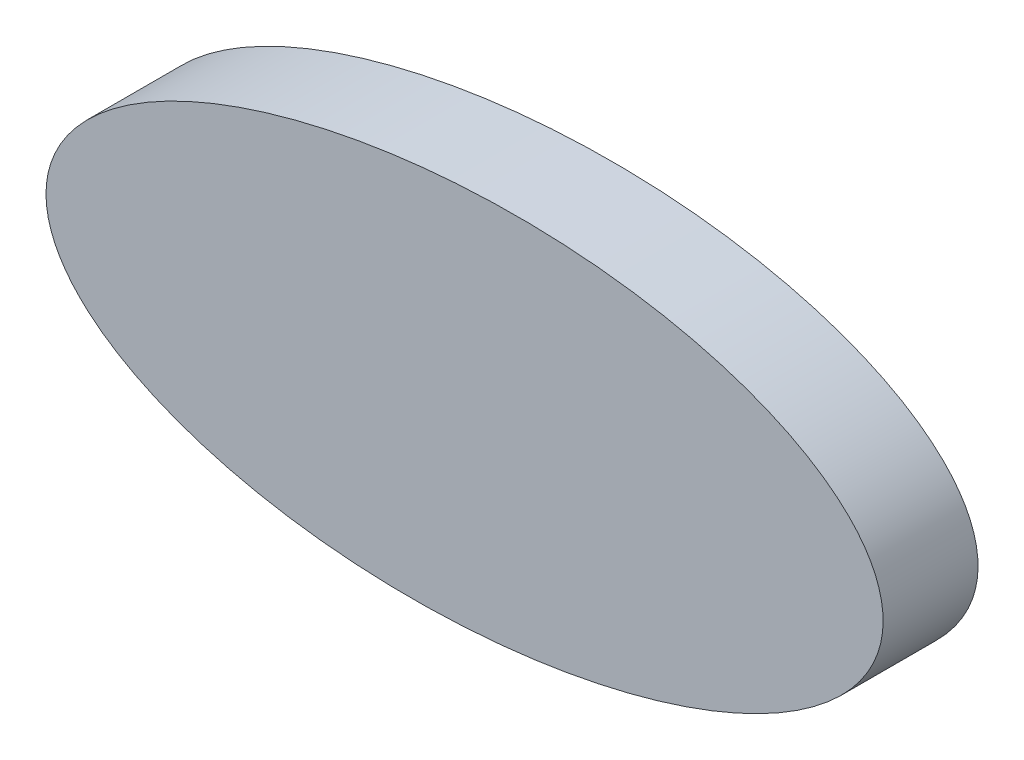
ISO-10303-21;
HEADER;
FILE_DESCRIPTION(('STEP AP214'),'2;1');
FILE_NAME('part.step','',(''),(''),'','','');
FILE_SCHEMA(('AUTOMOTIVE_DESIGN { 1 0 10303 214 1 1 1 1 }'));
ENDSEC;
DATA;
#1=APPLICATION_CONTEXT('core data for automotive mechanical design processes');
#2=APPLICATION_PROTOCOL_DEFINITION('international standard','automotive_design',2000,#1);
#3=PRODUCT_CONTEXT('',#1,'mechanical');
#4=PRODUCT('Part','Part','',(#3));
#5=PRODUCT_RELATED_PRODUCT_CATEGORY('part','',(#4));
#6=PRODUCT_DEFINITION_FORMATION('','',#4);
#7=PRODUCT_DEFINITION_CONTEXT('part definition',#1,'design');
#8=PRODUCT_DEFINITION('design','',#6,#7);
#9=PRODUCT_DEFINITION_SHAPE('','',#8);
#10=(LENGTH_UNIT() NAMED_UNIT(*) SI_UNIT(.MILLI.,.METRE.));
#11=(NAMED_UNIT(*) PLANE_ANGLE_UNIT() SI_UNIT($,.RADIAN.));
#12=(NAMED_UNIT(*) SI_UNIT($,.STERADIAN.) SOLID_ANGLE_UNIT());
#13=UNCERTAINTY_MEASURE_WITH_UNIT(LENGTH_MEASURE(1.E-05),#10,'distance_accuracy_value','');
#14=(GEOMETRIC_REPRESENTATION_CONTEXT(3) GLOBAL_UNCERTAINTY_ASSIGNED_CONTEXT((#13)) GLOBAL_UNIT_ASSIGNED_CONTEXT((#10,
#11,#12)) REPRESENTATION_CONTEXT('',''));
#15=CARTESIAN_POINT('',(0.,0.,0.));
#16=DIRECTION('',(0.,0.,1.));
#17=DIRECTION('',(1.,0.,0.));
#18=AXIS2_PLACEMENT_3D('',#15,#16,#17);
#19=CARTESIAN_POINT('',(0.,0.,10.));
#20=DIRECTION('',(0.,0.,1.));
#21=DIRECTION('',(0.997317456815691,0.0731976115094086,0.));
#22=AXIS2_PLACEMENT_3D('',#19,#20,#21);
#23=ELLIPSE('',#22,44.1957785805804,20.0055734437169);
#24=DIRECTION('',(0.,0.,-1.));
#25=VECTOR('',#24,1.);
#26=SURFACE_OF_LINEAR_EXTRUSION('',#23,#25);
#27=CARTESIAN_POINT('',(44.0772214959739,3.23502543089717,10.));
#28=VERTEX_POINT('',#27);
#29=EDGE_CURVE('E10',#28,#28,#23,.T.);
#30=ORIENTED_EDGE('',*,*,#29,.F.);
#31=EDGE_LOOP('',(#30));
#32=FACE_BOUND('',#31,.T.);
#33=CARTESIAN_POINT('',(0.,0.,0.));
#34=DIRECTION('',(0.,0.,1.));
#35=DIRECTION('',(0.997317456815691,0.0731976115094086,0.));
#36=AXIS2_PLACEMENT_3D('',#33,#34,#35);
#37=ELLIPSE('',#36,44.1957785805804,20.0055734437169);
#38=CARTESIAN_POINT('',(44.0772214959739,3.23502543089717,0.));
#39=VERTEX_POINT('',#38);
#40=EDGE_CURVE('E41',#39,#39,#37,.T.);
#41=ORIENTED_EDGE('',*,*,#40,.T.);
#42=EDGE_LOOP('',(#41));
#43=FACE_BOUND('',#42,.T.);
#44=ADVANCED_FACE('F37',(#32,#43),#26,.F.);
#45=CARTESIAN_POINT('',(0.,0.,10.));
#46=DIRECTION('',(0.,0.,1.));
#47=DIRECTION('',(1.,0.,0.));
#48=AXIS2_PLACEMENT_3D('',#45,#46,#47);
#49=PLANE('',#48);
#50=ORIENTED_EDGE('',*,*,#29,.T.);
#51=EDGE_LOOP('',(#50));
#52=FACE_BOUND('',#51,.T.);
#53=ADVANCED_FACE('F55',(#52),#49,.T.);
#54=CARTESIAN_POINT('',(0.,0.,0.));
#55=DIRECTION('',(0.,0.,1.));
#56=DIRECTION('',(1.,0.,0.));
#57=AXIS2_PLACEMENT_3D('',#54,#55,#56);
#58=PLANE('',#57);
#59=ORIENTED_EDGE('',*,*,#40,.F.);
#60=EDGE_LOOP('',(#59));
#61=FACE_BOUND('',#60,.T.);
#62=ADVANCED_FACE('F53',(#61),#58,.F.);
#63=CLOSED_SHELL('',(#44,#53,#62));
#64=MANIFOLD_SOLID_BREP('B2',#63);
#65=ADVANCED_BREP_SHAPE_REPRESENTATION('',(#18,#64),#14);
#66=SHAPE_DEFINITION_REPRESENTATION(#9,#65);
ENDSEC;
END-ISO-10303-21;
